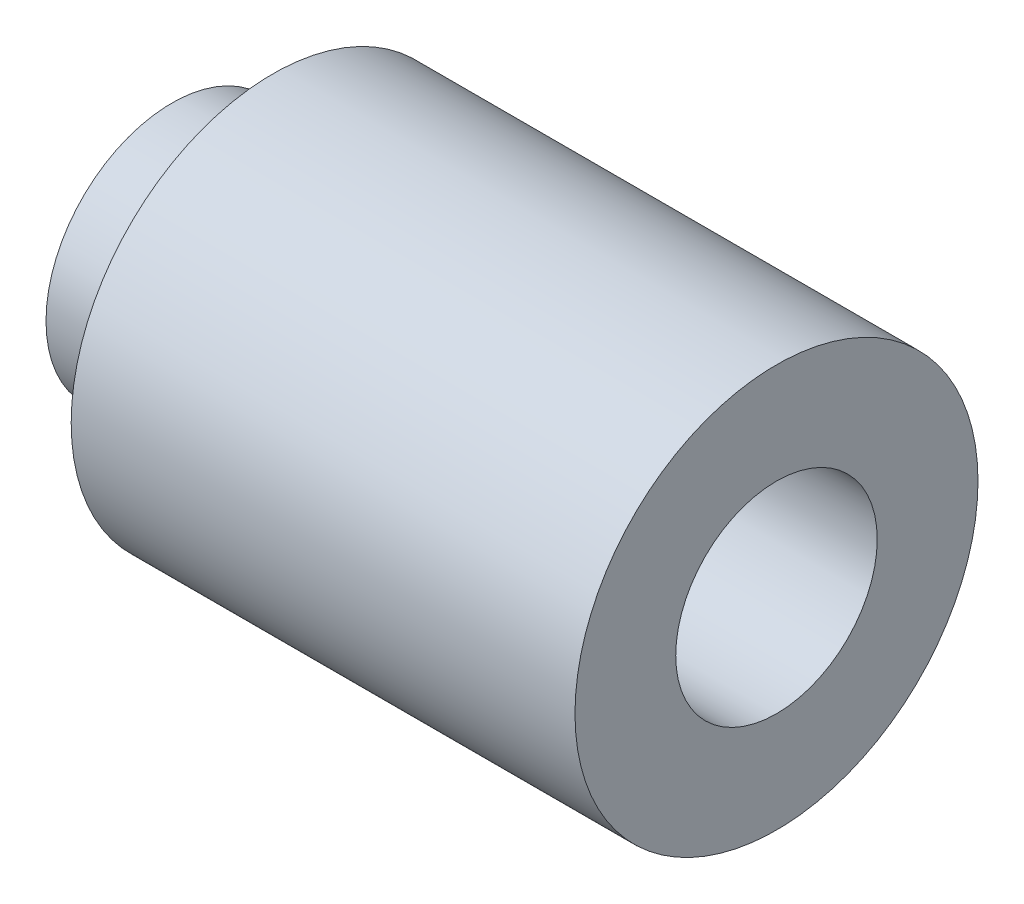
ISO-10303-21;
HEADER;
FILE_DESCRIPTION(('STEP AP214'),'2;1');
FILE_NAME('part.step','',(''),(''),'','','');
FILE_SCHEMA(('AUTOMOTIVE_DESIGN { 1 0 10303 214 1 1 1 1 }'));
ENDSEC;
DATA;
#1=APPLICATION_CONTEXT('core data for automotive mechanical design processes');
#2=APPLICATION_PROTOCOL_DEFINITION('international standard','automotive_design',2000,#1);
#3=PRODUCT_CONTEXT('',#1,'mechanical');
#4=PRODUCT('Part','Part','',(#3));
#5=PRODUCT_RELATED_PRODUCT_CATEGORY('part','',(#4));
#6=PRODUCT_DEFINITION_FORMATION('','',#4);
#7=PRODUCT_DEFINITION_CONTEXT('part definition',#1,'design');
#8=PRODUCT_DEFINITION('design','',#6,#7);
#9=PRODUCT_DEFINITION_SHAPE('','',#8);
#10=(LENGTH_UNIT() NAMED_UNIT(*) SI_UNIT(.MILLI.,.METRE.));
#11=(NAMED_UNIT(*) PLANE_ANGLE_UNIT() SI_UNIT($,.RADIAN.));
#12=(NAMED_UNIT(*) SI_UNIT($,.STERADIAN.) SOLID_ANGLE_UNIT());
#13=UNCERTAINTY_MEASURE_WITH_UNIT(LENGTH_MEASURE(1.E-05),#10,'distance_accuracy_value','');
#14=(GEOMETRIC_REPRESENTATION_CONTEXT(3) GLOBAL_UNCERTAINTY_ASSIGNED_CONTEXT((#13)) GLOBAL_UNIT_ASSIGNED_CONTEXT((#10,
#11,#12)) REPRESENTATION_CONTEXT('',''));
#15=CARTESIAN_POINT('',(0.,0.,0.));
#16=DIRECTION('',(0.,0.,1.));
#17=DIRECTION('',(1.,0.,0.));
#18=AXIS2_PLACEMENT_3D('',#15,#16,#17);
#19=CARTESIAN_POINT('',(0.,0.,0.));
#20=DIRECTION('',(1.,0.,0.));
#21=DIRECTION('',(0.,0.,-1.));
#22=AXIS2_PLACEMENT_3D('',#19,#20,#21);
#23=PLANE('',#22);
#24=CARTESIAN_POINT('',(0.,0.,0.));
#25=DIRECTION('',(1.,0.,0.));
#26=DIRECTION('',(0.,0.,-1.));
#27=AXIS2_PLACEMENT_3D('',#24,#25,#26);
#28=CIRCLE('',#27,4.);
#29=CARTESIAN_POINT('',(0.,0.,-4.));
#30=VERTEX_POINT('',#29);
#31=EDGE_CURVE('E52',#30,#30,#28,.T.);
#32=ORIENTED_EDGE('',*,*,#31,.F.);
#33=EDGE_LOOP('',(#32));
#34=FACE_BOUND('',#33,.T.);
#35=CARTESIAN_POINT('',(0.,0.,0.));
#36=DIRECTION('',(1.,0.,0.));
#37=DIRECTION('',(0.,0.,-1.));
#38=AXIS2_PLACEMENT_3D('',#35,#36,#37);
#39=CIRCLE('',#38,2.5);
#40=CARTESIAN_POINT('',(0.,0.,-2.5));
#41=VERTEX_POINT('',#40);
#42=EDGE_CURVE('E10',#41,#41,#39,.F.);
#43=ORIENTED_EDGE('',*,*,#42,.F.);
#44=EDGE_LOOP('',(#43));
#45=FACE_BOUND('',#44,.T.);
#46=ADVANCED_FACE('F39',(#34,#45),#23,.F.);
#47=CARTESIAN_POINT('',(10.,0.,0.));
#48=DIRECTION('',(1.,0.,0.));
#49=DIRECTION('',(0.,0.,-1.));
#50=AXIS2_PLACEMENT_3D('',#47,#48,#49);
#51=PLANE('',#50);
#52=CARTESIAN_POINT('',(10.,0.,0.));
#53=DIRECTION('',(1.,0.,0.));
#54=DIRECTION('',(0.,0.,-1.));
#55=AXIS2_PLACEMENT_3D('',#52,#53,#54);
#56=CIRCLE('',#55,4.);
#57=CARTESIAN_POINT('',(10.,0.,-4.));
#58=VERTEX_POINT('',#57);
#59=EDGE_CURVE('E47',#58,#58,#56,.T.);
#60=ORIENTED_EDGE('',*,*,#59,.T.);
#61=EDGE_LOOP('',(#60));
#62=FACE_BOUND('',#61,.T.);
#63=CARTESIAN_POINT('',(10.,0.,0.));
#64=DIRECTION('',(1.,0.,0.));
#65=DIRECTION('',(0.,0.,-1.));
#66=AXIS2_PLACEMENT_3D('',#63,#64,#65);
#67=CIRCLE('',#66,2.);
#68=CARTESIAN_POINT('',(10.,0.,-2.));
#69=VERTEX_POINT('',#68);
#70=EDGE_CURVE('E58',#69,#69,#67,.T.);
#71=ORIENTED_EDGE('',*,*,#70,.F.);
#72=EDGE_LOOP('',(#71));
#73=FACE_BOUND('',#72,.T.);
#74=ADVANCED_FACE('F88',(#62,#73),#51,.T.);
#75=CARTESIAN_POINT('',(10.,0.,0.));
#76=DIRECTION('',(-1.,0.,0.));
#77=DIRECTION('',(0.,0.,1.));
#78=AXIS2_PLACEMENT_3D('',#75,#76,#77);
#79=CYLINDRICAL_SURFACE('',#78,4.);
#80=ORIENTED_EDGE('',*,*,#59,.F.);
#81=EDGE_LOOP('',(#80));
#82=FACE_BOUND('',#81,.T.);
#83=ORIENTED_EDGE('',*,*,#31,.T.);
#84=EDGE_LOOP('',(#83));
#85=FACE_BOUND('',#84,.T.);
#86=ADVANCED_FACE('F41',(#82,#85),#79,.T.);
#87=CARTESIAN_POINT('',(10.,0.,0.));
#88=DIRECTION('',(-1.,0.,0.));
#89=DIRECTION('',(0.,0.,1.));
#90=AXIS2_PLACEMENT_3D('',#87,#88,#89);
#91=CYLINDRICAL_SURFACE('',#90,2.);
#92=ORIENTED_EDGE('',*,*,#70,.T.);
#93=EDGE_LOOP('',(#92));
#94=FACE_BOUND('',#93,.T.);
#95=CARTESIAN_POINT('',(-2.,0.,0.));
#96=DIRECTION('',(-1.,0.,0.));
#97=DIRECTION('',(0.,0.,1.));
#98=AXIS2_PLACEMENT_3D('',#95,#96,#97);
#99=CIRCLE('',#98,2.);
#100=CARTESIAN_POINT('',(-2.,0.,2.));
#101=VERTEX_POINT('',#100);
#102=EDGE_CURVE('E67',#101,#101,#99,.T.);
#103=ORIENTED_EDGE('',*,*,#102,.T.);
#104=EDGE_LOOP('',(#103));
#105=FACE_BOUND('',#104,.T.);
#106=ADVANCED_FACE('F72',(#94,#105),#91,.F.);
#107=CARTESIAN_POINT('',(-2.,0.,0.));
#108=DIRECTION('',(-1.,0.,0.));
#109=DIRECTION('',(0.,0.,1.));
#110=AXIS2_PLACEMENT_3D('',#107,#108,#109);
#111=PLANE('',#110);
#112=CARTESIAN_POINT('',(-2.,0.,0.));
#113=DIRECTION('',(-1.,0.,0.));
#114=DIRECTION('',(0.,0.,1.));
#115=AXIS2_PLACEMENT_3D('',#112,#113,#114);
#116=CIRCLE('',#115,2.5);
#117=CARTESIAN_POINT('',(-2.,0.,2.5));
#118=VERTEX_POINT('',#117);
#119=EDGE_CURVE('E63',#118,#118,#116,.T.);
#120=ORIENTED_EDGE('',*,*,#119,.T.);
#121=EDGE_LOOP('',(#120));
#122=FACE_BOUND('',#121,.T.);
#123=ORIENTED_EDGE('',*,*,#102,.F.);
#124=EDGE_LOOP('',(#123));
#125=FACE_BOUND('',#124,.T.);
#126=ADVANCED_FACE('F74',(#122,#125),#111,.T.);
#127=CARTESIAN_POINT('',(-2.,0.,0.));
#128=DIRECTION('',(1.,0.,0.));
#129=DIRECTION('',(0.,0.,-1.));
#130=AXIS2_PLACEMENT_3D('',#127,#128,#129);
#131=CYLINDRICAL_SURFACE('',#130,2.5);
#132=ORIENTED_EDGE('',*,*,#119,.F.);
#133=EDGE_LOOP('',(#132));
#134=FACE_BOUND('',#133,.T.);
#135=ORIENTED_EDGE('',*,*,#42,.T.);
#136=EDGE_LOOP('',(#135));
#137=FACE_BOUND('',#136,.T.);
#138=ADVANCED_FACE('F76',(#134,#137),#131,.T.);
#139=CLOSED_SHELL('',(#46,#74,#86,#106,#126,#138));
#140=MANIFOLD_SOLID_BREP('B2',#139);
#141=ADVANCED_BREP_SHAPE_REPRESENTATION('',(#18,#140),#14);
#142=SHAPE_DEFINITION_REPRESENTATION(#9,#141);
ENDSEC;
END-ISO-10303-21;
